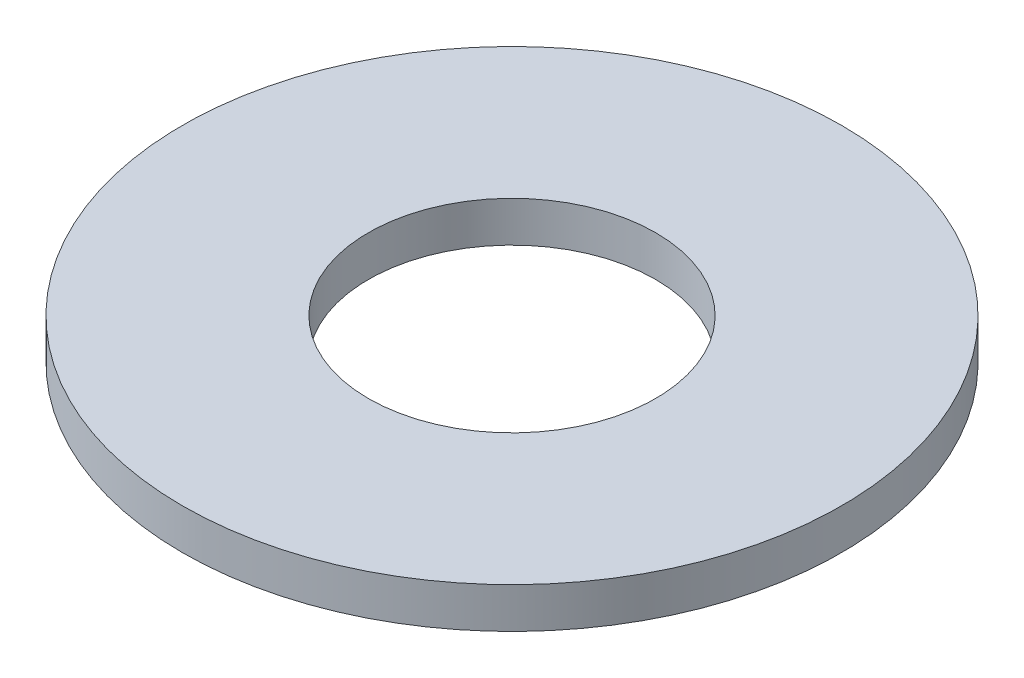
ISO-10303-21;
HEADER;
FILE_DESCRIPTION(('STEP AP214'),'2;1');
FILE_NAME('part.step','',(''),(''),'','','');
FILE_SCHEMA(('AUTOMOTIVE_DESIGN { 1 0 10303 214 1 1 1 1 }'));
ENDSEC;
DATA;
#1=APPLICATION_CONTEXT('core data for automotive mechanical design processes');
#2=APPLICATION_PROTOCOL_DEFINITION('international standard','automotive_design',2000,#1);
#3=PRODUCT_CONTEXT('',#1,'mechanical');
#4=PRODUCT('Part','Part','',(#3));
#5=PRODUCT_RELATED_PRODUCT_CATEGORY('part','',(#4));
#6=PRODUCT_DEFINITION_FORMATION('','',#4);
#7=PRODUCT_DEFINITION_CONTEXT('part definition',#1,'design');
#8=PRODUCT_DEFINITION('design','',#6,#7);
#9=PRODUCT_DEFINITION_SHAPE('','',#8);
#10=(LENGTH_UNIT() NAMED_UNIT(*) SI_UNIT(.MILLI.,.METRE.));
#11=(NAMED_UNIT(*) PLANE_ANGLE_UNIT() SI_UNIT($,.RADIAN.));
#12=(NAMED_UNIT(*) SI_UNIT($,.STERADIAN.) SOLID_ANGLE_UNIT());
#13=UNCERTAINTY_MEASURE_WITH_UNIT(LENGTH_MEASURE(1.E-05),#10,'distance_accuracy_value','');
#14=(GEOMETRIC_REPRESENTATION_CONTEXT(3) GLOBAL_UNCERTAINTY_ASSIGNED_CONTEXT((#13)) GLOBAL_UNIT_ASSIGNED_CONTEXT((#10,
#11,#12)) REPRESENTATION_CONTEXT('',''));
#15=CARTESIAN_POINT('',(0.,0.,0.));
#16=DIRECTION('',(0.,0.,1.));
#17=DIRECTION('',(1.,0.,0.));
#18=AXIS2_PLACEMENT_3D('',#15,#16,#17);
#19=CARTESIAN_POINT('',(0.,12.,0.));
#20=DIRECTION('',(0.,-1.,0.));
#21=DIRECTION('',(0.,0.,-1.));
#22=AXIS2_PLACEMENT_3D('',#19,#20,#21);
#23=CYLINDRICAL_SURFACE('',#22,97.5);
#24=CARTESIAN_POINT('',(0.,12.,0.));
#25=DIRECTION('',(0.,1.,0.));
#26=DIRECTION('',(0.,0.,1.));
#27=AXIS2_PLACEMENT_3D('',#24,#25,#26);
#28=CIRCLE('',#27,97.5);
#29=CARTESIAN_POINT('',(0.,12.,97.5));
#30=VERTEX_POINT('',#29);
#31=EDGE_CURVE('E10',#30,#30,#28,.T.);
#32=ORIENTED_EDGE('',*,*,#31,.F.);
#33=EDGE_LOOP('',(#32));
#34=FACE_BOUND('',#33,.T.);
#35=CARTESIAN_POINT('',(0.,0.,0.));
#36=DIRECTION('',(0.,1.,0.));
#37=DIRECTION('',(0.,0.,1.));
#38=AXIS2_PLACEMENT_3D('',#35,#36,#37);
#39=CIRCLE('',#38,97.5);
#40=CARTESIAN_POINT('',(0.,0.,97.5));
#41=VERTEX_POINT('',#40);
#42=EDGE_CURVE('E37',#41,#41,#39,.T.);
#43=ORIENTED_EDGE('',*,*,#42,.T.);
#44=EDGE_LOOP('',(#43));
#45=FACE_BOUND('',#44,.T.);
#46=ADVANCED_FACE('F40',(#34,#45),#23,.T.);
#47=CARTESIAN_POINT('',(0.,12.,0.));
#48=DIRECTION('',(0.,1.,0.));
#49=DIRECTION('',(0.,0.,1.));
#50=AXIS2_PLACEMENT_3D('',#47,#48,#49);
#51=PLANE('',#50);
#52=CARTESIAN_POINT('',(0.,12.,0.));
#53=DIRECTION('',(0.,1.,0.));
#54=DIRECTION('',(0.,0.,1.));
#55=AXIS2_PLACEMENT_3D('',#52,#53,#54);
#56=CIRCLE('',#55,42.5);
#57=CARTESIAN_POINT('',(0.,12.,42.5));
#58=VERTEX_POINT('',#57);
#59=EDGE_CURVE('E50',#58,#58,#56,.T.);
#60=ORIENTED_EDGE('',*,*,#59,.F.);
#61=EDGE_LOOP('',(#60));
#62=FACE_BOUND('',#61,.T.);
#63=ORIENTED_EDGE('',*,*,#31,.T.);
#64=EDGE_LOOP('',(#63));
#65=FACE_BOUND('',#64,.T.);
#66=ADVANCED_FACE('F59',(#62,#65),#51,.T.);
#67=CARTESIAN_POINT('',(0.,0.,0.));
#68=DIRECTION('',(0.,1.,0.));
#69=DIRECTION('',(0.,0.,1.));
#70=AXIS2_PLACEMENT_3D('',#67,#68,#69);
#71=PLANE('',#70);
#72=CARTESIAN_POINT('',(0.,0.,0.));
#73=DIRECTION('',(0.,1.,0.));
#74=DIRECTION('',(0.,0.,1.));
#75=AXIS2_PLACEMENT_3D('',#72,#73,#74);
#76=CIRCLE('',#75,42.5);
#77=CARTESIAN_POINT('',(0.,0.,42.5));
#78=VERTEX_POINT('',#77);
#79=EDGE_CURVE('E47',#78,#78,#76,.T.);
#80=ORIENTED_EDGE('',*,*,#79,.T.);
#81=EDGE_LOOP('',(#80));
#82=FACE_BOUND('',#81,.T.);
#83=ORIENTED_EDGE('',*,*,#42,.F.);
#84=EDGE_LOOP('',(#83));
#85=FACE_BOUND('',#84,.T.);
#86=ADVANCED_FACE('F58',(#82,#85),#71,.F.);
#87=CARTESIAN_POINT('',(0.,12.,0.));
#88=DIRECTION('',(0.,-1.,0.));
#89=DIRECTION('',(0.,0.,-1.));
#90=AXIS2_PLACEMENT_3D('',#87,#88,#89);
#91=CYLINDRICAL_SURFACE('',#90,42.5);
#92=ORIENTED_EDGE('',*,*,#59,.T.);
#93=EDGE_LOOP('',(#92));
#94=FACE_BOUND('',#93,.T.);
#95=ORIENTED_EDGE('',*,*,#79,.F.);
#96=EDGE_LOOP('',(#95));
#97=FACE_BOUND('',#96,.T.);
#98=ADVANCED_FACE('F54',(#94,#97),#91,.F.);
#99=CLOSED_SHELL('',(#46,#66,#86,#98));
#100=MANIFOLD_SOLID_BREP('B2',#99);
#101=ADVANCED_BREP_SHAPE_REPRESENTATION('',(#18,#100),#14);
#102=SHAPE_DEFINITION_REPRESENTATION(#9,#101);
ENDSEC;
END-ISO-10303-21;
